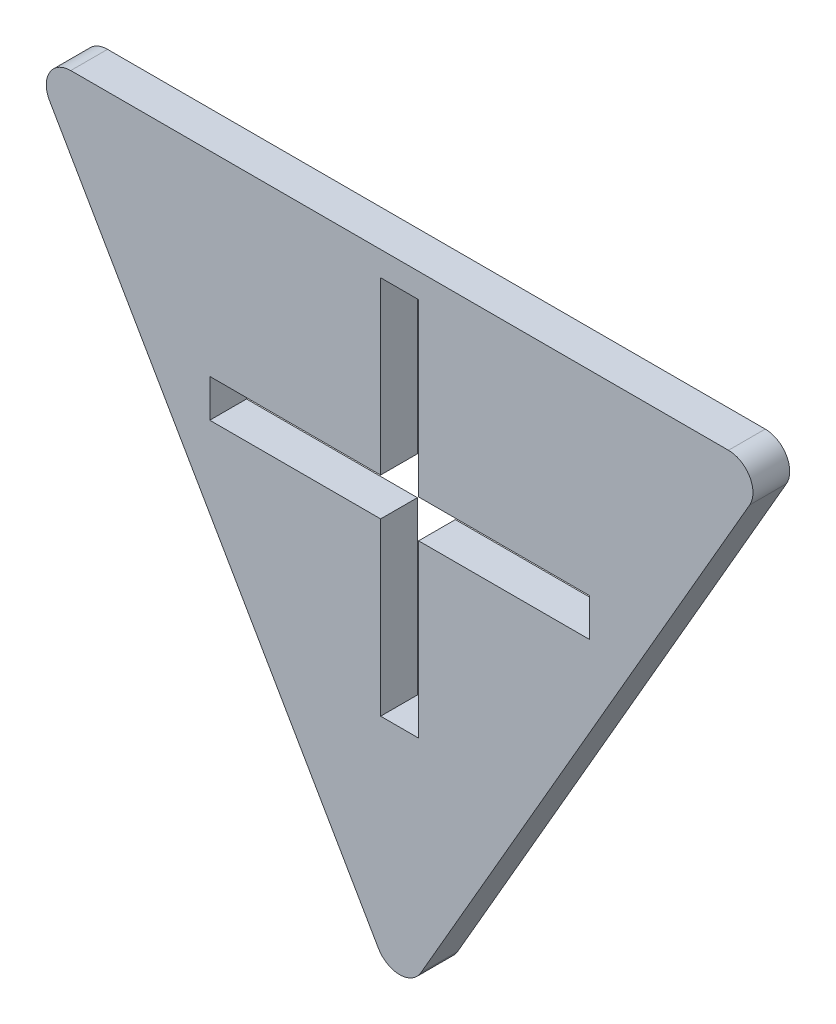
ISO-10303-21;
HEADER;
FILE_DESCRIPTION(('STEP AP214'),'2;1');
FILE_NAME('part.step','',(''),(''),'','','');
FILE_SCHEMA(('AUTOMOTIVE_DESIGN { 1 0 10303 214 1 1 1 1 }'));
ENDSEC;
DATA;
#1=APPLICATION_CONTEXT('core data for automotive mechanical design processes');
#2=APPLICATION_PROTOCOL_DEFINITION('international standard','automotive_design',2000,#1);
#3=PRODUCT_CONTEXT('',#1,'mechanical');
#4=PRODUCT('Part','Part','',(#3));
#5=PRODUCT_RELATED_PRODUCT_CATEGORY('part','',(#4));
#6=PRODUCT_DEFINITION_FORMATION('','',#4);
#7=PRODUCT_DEFINITION_CONTEXT('part definition',#1,'design');
#8=PRODUCT_DEFINITION('design','',#6,#7);
#9=PRODUCT_DEFINITION_SHAPE('','',#8);
#10=(LENGTH_UNIT() NAMED_UNIT(*) SI_UNIT(.MILLI.,.METRE.));
#11=(NAMED_UNIT(*) PLANE_ANGLE_UNIT() SI_UNIT($,.RADIAN.));
#12=(NAMED_UNIT(*) SI_UNIT($,.STERADIAN.) SOLID_ANGLE_UNIT());
#13=UNCERTAINTY_MEASURE_WITH_UNIT(LENGTH_MEASURE(1.E-05),#10,'distance_accuracy_value','');
#14=(GEOMETRIC_REPRESENTATION_CONTEXT(3) GLOBAL_UNCERTAINTY_ASSIGNED_CONTEXT((#13)) GLOBAL_UNIT_ASSIGNED_CONTEXT((#10,
#11,#12)) REPRESENTATION_CONTEXT('',''));
#15=CARTESIAN_POINT('',(0.,0.,0.));
#16=DIRECTION('',(0.,0.,1.));
#17=DIRECTION('',(1.,0.,0.));
#18=AXIS2_PLACEMENT_3D('',#15,#16,#17);
#19=CARTESIAN_POINT('',(0.,17.5,1.5));
#20=DIRECTION('',(0.,-1.,0.));
#21=DIRECTION('',(0.,0.,-1.));
#22=AXIS2_PLACEMENT_3D('',#19,#20,#21);
#23=PLANE('',#22);
#24=DIRECTION('',(-1.,0.,0.));
#25=VECTOR('',#24,1.);
#26=CARTESIAN_POINT('',(0.,17.5,-1.5));
#27=LINE('',#26,#25);
#28=CARTESIAN_POINT('',(26.8467875173176,17.5,-1.5));
#29=VERTEX_POINT('',#28);
#30=CARTESIAN_POINT('',(-26.8467875173176,17.5,-1.5));
#31=VERTEX_POINT('',#30);
#32=EDGE_CURVE('E224',#29,#31,#27,.T.);
#33=ORIENTED_EDGE('',*,*,#32,.T.);
#34=DIRECTION('',(0.,0.,-1.));
#35=VECTOR('',#34,1.);
#36=CARTESIAN_POINT('',(-26.8467875173176,17.5,1.5));
#37=LINE('',#36,#35);
#38=CARTESIAN_POINT('',(-26.8467875173176,17.5,1.5));
#39=VERTEX_POINT('',#38);
#40=EDGE_CURVE('E11',#39,#31,#37,.T.);
#41=ORIENTED_EDGE('',*,*,#40,.F.);
#42=DIRECTION('',(-1.,0.,0.));
#43=VECTOR('',#42,1.);
#44=CARTESIAN_POINT('',(0.,17.5,1.5));
#45=LINE('',#44,#43);
#46=CARTESIAN_POINT('',(26.8467875173176,17.5,1.5));
#47=VERTEX_POINT('',#46);
#48=EDGE_CURVE('E322',#47,#39,#45,.T.);
#49=ORIENTED_EDGE('',*,*,#48,.F.);
#50=DIRECTION('',(0.,0.,-1.));
#51=VECTOR('',#50,1.);
#52=CARTESIAN_POINT('',(26.8467875173176,17.5,1.5));
#53=LINE('',#52,#51);
#54=EDGE_CURVE('E236',#47,#29,#53,.T.);
#55=ORIENTED_EDGE('',*,*,#54,.T.);
#56=EDGE_LOOP('',(#33,#41,#49,#55));
#57=FACE_BOUND('',#56,.T.);
#58=ADVANCED_FACE('F35',(#57),#23,.F.);
#59=CARTESIAN_POINT('',(-26.8467875173176,15.5,1.5));
#60=DIRECTION('',(0.,0.,-1.));
#61=DIRECTION('',(-1.,0.,0.));
#62=AXIS2_PLACEMENT_3D('',#59,#60,#61);
#63=CYLINDRICAL_SURFACE('',#62,2.);
#64=CARTESIAN_POINT('',(-26.8467875173176,15.5,-1.5));
#65=DIRECTION('',(0.,0.,1.));
#66=DIRECTION('',(1.,0.,0.));
#67=AXIS2_PLACEMENT_3D('',#64,#65,#66);
#68=CIRCLE('',#67,2.);
#69=CARTESIAN_POINT('',(-28.5788383248865,14.5,-1.5));
#70=VERTEX_POINT('',#69);
#71=EDGE_CURVE('E227',#31,#70,#68,.T.);
#72=ORIENTED_EDGE('',*,*,#71,.T.);
#73=DIRECTION('',(0.,0.,-1.));
#74=VECTOR('',#73,1.);
#75=CARTESIAN_POINT('',(-28.5788383248865,14.5,1.5));
#76=LINE('',#75,#74);
#77=CARTESIAN_POINT('',(-28.5788383248865,14.5,1.5));
#78=VERTEX_POINT('',#77);
#79=EDGE_CURVE('E45',#78,#70,#76,.T.);
#80=ORIENTED_EDGE('',*,*,#79,.F.);
#81=CARTESIAN_POINT('',(-26.8467875173176,15.5,1.5));
#82=DIRECTION('',(0.,0.,1.));
#83=DIRECTION('',(1.,0.,0.));
#84=AXIS2_PLACEMENT_3D('',#81,#82,#83);
#85=CIRCLE('',#84,2.);
#86=EDGE_CURVE('E191',#39,#78,#85,.T.);
#87=ORIENTED_EDGE('',*,*,#86,.F.);
#88=ORIENTED_EDGE('',*,*,#40,.T.);
#89=EDGE_LOOP('',(#72,#80,#87,#88));
#90=FACE_BOUND('',#89,.T.);
#91=ADVANCED_FACE('F353',(#90),#63,.T.);
#92=CARTESIAN_POINT('',(-15.1554445662277,-8.74999999999999,1.5));
#93=DIRECTION('',(0.866025403784439,0.5,0.));
#94=DIRECTION('',(-0.5,0.866025403784439,0.));
#95=AXIS2_PLACEMENT_3D('',#92,#93,#94);
#96=PLANE('',#95);
#97=DIRECTION('',(0.5,-0.866025403784439,0.));
#98=VECTOR('',#97,1.);
#99=CARTESIAN_POINT('',(-15.1554445662277,-8.74999999999999,-1.5));
#100=LINE('',#99,#98);
#101=CARTESIAN_POINT('',(-1.73205080756888,-32.,-1.5));
#102=VERTEX_POINT('',#101);
#103=EDGE_CURVE('E229',#70,#102,#100,.T.);
#104=ORIENTED_EDGE('',*,*,#103,.T.);
#105=DIRECTION('',(0.,0.,-1.));
#106=VECTOR('',#105,1.);
#107=CARTESIAN_POINT('',(-1.73205080756888,-32.,1.5));
#108=LINE('',#107,#106);
#109=CARTESIAN_POINT('',(-1.73205080756888,-32.,1.5));
#110=VERTEX_POINT('',#109);
#111=EDGE_CURVE('E180',#110,#102,#108,.T.);
#112=ORIENTED_EDGE('',*,*,#111,.F.);
#113=DIRECTION('',(0.5,-0.866025403784439,0.));
#114=VECTOR('',#113,1.);
#115=CARTESIAN_POINT('',(-15.1554445662277,-8.74999999999999,1.5));
#116=LINE('',#115,#114);
#117=EDGE_CURVE('E188',#78,#110,#116,.T.);
#118=ORIENTED_EDGE('',*,*,#117,.F.);
#119=ORIENTED_EDGE('',*,*,#79,.T.);
#120=EDGE_LOOP('',(#104,#112,#118,#119));
#121=FACE_BOUND('',#120,.T.);
#122=ADVANCED_FACE('F359',(#121),#96,.F.);
#123=CARTESIAN_POINT('',(0.,-31.,1.5));
#124=DIRECTION('',(0.,0.,-1.));
#125=DIRECTION('',(-1.,0.,0.));
#126=AXIS2_PLACEMENT_3D('',#123,#124,#125);
#127=CYLINDRICAL_SURFACE('',#126,2.);
#128=CARTESIAN_POINT('',(0.,-31.,-1.5));
#129=DIRECTION('',(0.,0.,1.));
#130=DIRECTION('',(1.,0.,0.));
#131=AXIS2_PLACEMENT_3D('',#128,#129,#130);
#132=CIRCLE('',#131,2.);
#133=CARTESIAN_POINT('',(1.73205080756888,-32.,-1.5));
#134=VERTEX_POINT('',#133);
#135=EDGE_CURVE('E179',#134,#102,#132,.F.);
#136=ORIENTED_EDGE('',*,*,#135,.F.);
#137=DIRECTION('',(0.,0.,-1.));
#138=VECTOR('',#137,1.);
#139=CARTESIAN_POINT('',(1.73205080756888,-32.,1.5));
#140=LINE('',#139,#138);
#141=CARTESIAN_POINT('',(1.73205080756888,-32.,1.5));
#142=VERTEX_POINT('',#141);
#143=EDGE_CURVE('E173',#142,#134,#140,.T.);
#144=ORIENTED_EDGE('',*,*,#143,.F.);
#145=CARTESIAN_POINT('',(0.,-31.,1.5));
#146=DIRECTION('',(0.,0.,1.));
#147=DIRECTION('',(1.,0.,0.));
#148=AXIS2_PLACEMENT_3D('',#145,#146,#147);
#149=CIRCLE('',#148,2.);
#150=EDGE_CURVE('E177',#142,#110,#149,.F.);
#151=ORIENTED_EDGE('',*,*,#150,.T.);
#152=ORIENTED_EDGE('',*,*,#111,.T.);
#153=EDGE_LOOP('',(#136,#144,#151,#152));
#154=FACE_BOUND('',#153,.T.);
#155=ADVANCED_FACE('F175',(#154),#127,.T.);
#156=CARTESIAN_POINT('',(15.1554445662277,-8.75,1.5));
#157=DIRECTION('',(-0.866025403784439,0.5,0.));
#158=DIRECTION('',(-0.5,-0.866025403784439,0.));
#159=AXIS2_PLACEMENT_3D('',#156,#157,#158);
#160=PLANE('',#159);
#161=DIRECTION('',(0.5,0.866025403784439,0.));
#162=VECTOR('',#161,1.);
#163=CARTESIAN_POINT('',(15.1554445662277,-8.75,-1.5));
#164=LINE('',#163,#162);
#165=CARTESIAN_POINT('',(28.5788383248865,14.5,-1.5));
#166=VERTEX_POINT('',#165);
#167=EDGE_CURVE('E112',#134,#166,#164,.T.);
#168=ORIENTED_EDGE('',*,*,#167,.T.);
#169=DIRECTION('',(0.,0.,-1.));
#170=VECTOR('',#169,1.);
#171=CARTESIAN_POINT('',(28.5788383248865,14.5,1.5));
#172=LINE('',#171,#170);
#173=CARTESIAN_POINT('',(28.5788383248865,14.5,1.5));
#174=VERTEX_POINT('',#173);
#175=EDGE_CURVE('E181',#174,#166,#172,.T.);
#176=ORIENTED_EDGE('',*,*,#175,.F.);
#177=DIRECTION('',(0.5,0.866025403784439,0.));
#178=VECTOR('',#177,1.);
#179=CARTESIAN_POINT('',(15.1554445662277,-8.75,1.5));
#180=LINE('',#179,#178);
#181=EDGE_CURVE('E183',#142,#174,#180,.T.);
#182=ORIENTED_EDGE('',*,*,#181,.F.);
#183=ORIENTED_EDGE('',*,*,#143,.T.);
#184=EDGE_LOOP('',(#168,#176,#182,#183));
#185=FACE_BOUND('',#184,.T.);
#186=ADVANCED_FACE('F184',(#185),#160,.F.);
#187=CARTESIAN_POINT('',(0.,1.55000000000001,1.5));
#188=DIRECTION('',(0.,1.,0.));
#189=DIRECTION('',(0.,0.,1.));
#190=AXIS2_PLACEMENT_3D('',#187,#188,#189);
#191=PLANE('',#190);
#192=DIRECTION('',(1.,0.,0.));
#193=VECTOR('',#192,1.);
#194=CARTESIAN_POINT('',(0.,1.55000000000001,-1.5));
#195=LINE('',#194,#193);
#196=CARTESIAN_POINT('',(1.55,1.55000000000001,-1.5));
#197=VERTEX_POINT('',#196);
#198=CARTESIAN_POINT('',(15.5,1.55000000000001,-1.5));
#199=VERTEX_POINT('',#198);
#200=EDGE_CURVE('E197',#197,#199,#195,.T.);
#201=ORIENTED_EDGE('',*,*,#200,.T.);
#202=DIRECTION('',(0.,0.,-1.));
#203=VECTOR('',#202,1.);
#204=CARTESIAN_POINT('',(15.5,1.55000000000001,1.5));
#205=LINE('',#204,#203);
#206=CARTESIAN_POINT('',(15.5,1.55000000000001,1.5));
#207=VERTEX_POINT('',#206);
#208=EDGE_CURVE('E39',#207,#199,#205,.T.);
#209=ORIENTED_EDGE('',*,*,#208,.F.);
#210=DIRECTION('',(1.,0.,0.));
#211=VECTOR('',#210,1.);
#212=CARTESIAN_POINT('',(0.,1.55000000000001,1.5));
#213=LINE('',#212,#211);
#214=CARTESIAN_POINT('',(1.55,1.55000000000001,1.5));
#215=VERTEX_POINT('',#214);
#216=EDGE_CURVE('E235',#215,#207,#213,.T.);
#217=ORIENTED_EDGE('',*,*,#216,.F.);
#218=DIRECTION('',(0.,0.,-1.));
#219=VECTOR('',#218,1.);
#220=CARTESIAN_POINT('',(1.55,1.55000000000001,1.5));
#221=LINE('',#220,#219);
#222=EDGE_CURVE('E196',#215,#197,#221,.T.);
#223=ORIENTED_EDGE('',*,*,#222,.T.);
#224=EDGE_LOOP('',(#201,#209,#217,#223));
#225=FACE_BOUND('',#224,.T.);
#226=ADVANCED_FACE('F270',(#225),#191,.F.);
#227=CARTESIAN_POINT('',(15.5,0.,1.5));
#228=DIRECTION('',(1.,0.,0.));
#229=DIRECTION('',(0.,0.,-1.));
#230=AXIS2_PLACEMENT_3D('',#227,#228,#229);
#231=PLANE('',#230);
#232=DIRECTION('',(0.,-1.,0.));
#233=VECTOR('',#232,1.);
#234=CARTESIAN_POINT('',(15.5,0.,-1.5));
#235=LINE('',#234,#233);
#236=CARTESIAN_POINT('',(15.5,-1.54999999999999,-1.5));
#237=VERTEX_POINT('',#236);
#238=EDGE_CURVE('E200',#199,#237,#235,.T.);
#239=ORIENTED_EDGE('',*,*,#238,.T.);
#240=DIRECTION('',(0.,0.,-1.));
#241=VECTOR('',#240,1.);
#242=CARTESIAN_POINT('',(15.5,-1.54999999999999,1.5));
#243=LINE('',#242,#241);
#244=CARTESIAN_POINT('',(15.5,-1.54999999999999,1.5));
#245=VERTEX_POINT('',#244);
#246=EDGE_CURVE('E262',#245,#237,#243,.T.);
#247=ORIENTED_EDGE('',*,*,#246,.F.);
#248=DIRECTION('',(0.,-1.,0.));
#249=VECTOR('',#248,1.);
#250=CARTESIAN_POINT('',(15.5,0.,1.5));
#251=LINE('',#250,#249);
#252=EDGE_CURVE('E127',#207,#245,#251,.T.);
#253=ORIENTED_EDGE('',*,*,#252,.F.);
#254=ORIENTED_EDGE('',*,*,#208,.T.);
#255=EDGE_LOOP('',(#239,#247,#253,#254));
#256=FACE_BOUND('',#255,.T.);
#257=ADVANCED_FACE('F37',(#256),#231,.F.);
#258=CARTESIAN_POINT('',(0.,-1.54999999999999,1.5));
#259=DIRECTION('',(0.,1.,0.));
#260=DIRECTION('',(0.,0.,1.));
#261=AXIS2_PLACEMENT_3D('',#258,#259,#260);
#262=PLANE('',#261);
#263=DIRECTION('',(1.,0.,0.));
#264=VECTOR('',#263,1.);
#265=CARTESIAN_POINT('',(0.,-1.54999999999999,-1.5));
#266=LINE('',#265,#264);
#267=CARTESIAN_POINT('',(1.55,-1.54999999999999,-1.5));
#268=VERTEX_POINT('',#267);
#269=EDGE_CURVE('E204',#268,#237,#266,.T.);
#270=ORIENTED_EDGE('',*,*,#269,.F.);
#271=DIRECTION('',(0.,0.,-1.));
#272=VECTOR('',#271,1.);
#273=CARTESIAN_POINT('',(1.55,-1.54999999999999,1.5));
#274=LINE('',#273,#272);
#275=CARTESIAN_POINT('',(1.55,-1.54999999999999,1.5));
#276=VERTEX_POINT('',#275);
#277=EDGE_CURVE('E261',#276,#268,#274,.T.);
#278=ORIENTED_EDGE('',*,*,#277,.F.);
#279=DIRECTION('',(1.,0.,0.));
#280=VECTOR('',#279,1.);
#281=CARTESIAN_POINT('',(0.,-1.54999999999999,1.5));
#282=LINE('',#281,#280);
#283=EDGE_CURVE('E281',#276,#245,#282,.T.);
#284=ORIENTED_EDGE('',*,*,#283,.T.);
#285=ORIENTED_EDGE('',*,*,#246,.T.);
#286=EDGE_LOOP('',(#270,#278,#284,#285));
#287=FACE_BOUND('',#286,.T.);
#288=ADVANCED_FACE('F278',(#287),#262,.T.);
#289=CARTESIAN_POINT('',(1.55,0.,1.5));
#290=DIRECTION('',(1.,0.,0.));
#291=DIRECTION('',(0.,1.,0.));
#292=AXIS2_PLACEMENT_3D('',#289,#290,#291);
#293=PLANE('',#292);
#294=DIRECTION('',(0.,-1.,0.));
#295=VECTOR('',#294,1.);
#296=CARTESIAN_POINT('',(1.55,0.,-1.5));
#297=LINE('',#296,#295);
#298=CARTESIAN_POINT('',(1.55,-15.5,-1.5));
#299=VERTEX_POINT('',#298);
#300=EDGE_CURVE('E207',#268,#299,#297,.T.);
#301=ORIENTED_EDGE('',*,*,#300,.T.);
#302=DIRECTION('',(0.,0.,-1.));
#303=VECTOR('',#302,1.);
#304=CARTESIAN_POINT('',(1.55,-15.5,1.5));
#305=LINE('',#304,#303);
#306=CARTESIAN_POINT('',(1.55,-15.5,1.5));
#307=VERTEX_POINT('',#306);
#308=EDGE_CURVE('E259',#307,#299,#305,.T.);
#309=ORIENTED_EDGE('',*,*,#308,.F.);
#310=DIRECTION('',(0.,-1.,0.));
#311=VECTOR('',#310,1.);
#312=CARTESIAN_POINT('',(1.55,0.,1.5));
#313=LINE('',#312,#311);
#314=EDGE_CURVE('E284',#276,#307,#313,.T.);
#315=ORIENTED_EDGE('',*,*,#314,.F.);
#316=ORIENTED_EDGE('',*,*,#277,.T.);
#317=EDGE_LOOP('',(#301,#309,#315,#316));
#318=FACE_BOUND('',#317,.T.);
#319=ADVANCED_FACE('F285',(#318),#293,.F.);
#320=CARTESIAN_POINT('',(0.,-15.5,1.5));
#321=DIRECTION('',(0.,1.,0.));
#322=DIRECTION('',(0.,0.,1.));
#323=AXIS2_PLACEMENT_3D('',#320,#321,#322);
#324=PLANE('',#323);
#325=DIRECTION('',(1.,0.,0.));
#326=VECTOR('',#325,1.);
#327=CARTESIAN_POINT('',(0.,-15.5,-1.5));
#328=LINE('',#327,#326);
#329=CARTESIAN_POINT('',(-1.55,-15.5,-1.5));
#330=VERTEX_POINT('',#329);
#331=EDGE_CURVE('E211',#330,#299,#328,.T.);
#332=ORIENTED_EDGE('',*,*,#331,.F.);
#333=DIRECTION('',(0.,0.,-1.));
#334=VECTOR('',#333,1.);
#335=CARTESIAN_POINT('',(-1.55,-15.5,1.5));
#336=LINE('',#335,#334);
#337=CARTESIAN_POINT('',(-1.55,-15.5,1.5));
#338=VERTEX_POINT('',#337);
#339=EDGE_CURVE('E257',#338,#330,#336,.T.);
#340=ORIENTED_EDGE('',*,*,#339,.F.);
#341=DIRECTION('',(1.,0.,0.));
#342=VECTOR('',#341,1.);
#343=CARTESIAN_POINT('',(0.,-15.5,1.5));
#344=LINE('',#343,#342);
#345=EDGE_CURVE('E289',#338,#307,#344,.T.);
#346=ORIENTED_EDGE('',*,*,#345,.T.);
#347=ORIENTED_EDGE('',*,*,#308,.T.);
#348=EDGE_LOOP('',(#332,#340,#346,#347));
#349=FACE_BOUND('',#348,.T.);
#350=ADVANCED_FACE('F343',(#349),#324,.T.);
#351=CARTESIAN_POINT('',(-1.55,0.,1.5));
#352=DIRECTION('',(1.,0.,0.));
#353=DIRECTION('',(0.,1.,0.));
#354=AXIS2_PLACEMENT_3D('',#351,#352,#353);
#355=PLANE('',#354);
#356=DIRECTION('',(0.,-1.,0.));
#357=VECTOR('',#356,1.);
#358=CARTESIAN_POINT('',(-1.55,0.,-1.5));
#359=LINE('',#358,#357);
#360=CARTESIAN_POINT('',(-1.55,-1.54999999999999,-1.5));
#361=VERTEX_POINT('',#360);
#362=EDGE_CURVE('E215',#361,#330,#359,.T.);
#363=ORIENTED_EDGE('',*,*,#362,.F.);
#364=DIRECTION('',(0.,0.,-1.));
#365=VECTOR('',#364,1.);
#366=CARTESIAN_POINT('',(-1.55,-1.54999999999999,1.5));
#367=LINE('',#366,#365);
#368=CARTESIAN_POINT('',(-1.55,-1.54999999999999,1.5));
#369=VERTEX_POINT('',#368);
#370=EDGE_CURVE('E255',#369,#361,#367,.T.);
#371=ORIENTED_EDGE('',*,*,#370,.F.);
#372=DIRECTION('',(0.,-1.,0.));
#373=VECTOR('',#372,1.);
#374=CARTESIAN_POINT('',(-1.55,0.,1.5));
#375=LINE('',#374,#373);
#376=EDGE_CURVE('E297',#369,#338,#375,.T.);
#377=ORIENTED_EDGE('',*,*,#376,.T.);
#378=ORIENTED_EDGE('',*,*,#339,.T.);
#379=EDGE_LOOP('',(#363,#371,#377,#378));
#380=FACE_BOUND('',#379,.T.);
#381=ADVANCED_FACE('F341',(#380),#355,.T.);
#382=CARTESIAN_POINT('',(-15.5,-1.54999999999999,-1.5));
#383=VERTEX_POINT('',#382);
#384=EDGE_CURVE('E208',#383,#361,#266,.T.);
#385=ORIENTED_EDGE('',*,*,#384,.F.);
#386=DIRECTION('',(0.,0.,-1.));
#387=VECTOR('',#386,1.);
#388=CARTESIAN_POINT('',(-15.5,-1.54999999999999,1.5));
#389=LINE('',#388,#387);
#390=CARTESIAN_POINT('',(-15.5,-1.54999999999999,1.5));
#391=VERTEX_POINT('',#390);
#392=EDGE_CURVE('E253',#391,#383,#389,.T.);
#393=ORIENTED_EDGE('',*,*,#392,.F.);
#394=EDGE_CURVE('E293',#391,#369,#282,.T.);
#395=ORIENTED_EDGE('',*,*,#394,.T.);
#396=ORIENTED_EDGE('',*,*,#370,.T.);
#397=EDGE_LOOP('',(#385,#393,#395,#396));
#398=FACE_BOUND('',#397,.T.);
#399=ADVANCED_FACE('F338',(#398),#262,.T.);
#400=CARTESIAN_POINT('',(-15.5,0.,1.5));
#401=DIRECTION('',(1.,0.,0.));
#402=DIRECTION('',(0.,0.,-1.));
#403=AXIS2_PLACEMENT_3D('',#400,#401,#402);
#404=PLANE('',#403);
#405=DIRECTION('',(0.,-1.,0.));
#406=VECTOR('',#405,1.);
#407=CARTESIAN_POINT('',(-15.5,0.,-1.5));
#408=LINE('',#407,#406);
#409=CARTESIAN_POINT('',(-15.5,1.55000000000001,-1.5));
#410=VERTEX_POINT('',#409);
#411=EDGE_CURVE('E219',#410,#383,#408,.T.);
#412=ORIENTED_EDGE('',*,*,#411,.F.);
#413=DIRECTION('',(0.,0.,-1.));
#414=VECTOR('',#413,1.);
#415=CARTESIAN_POINT('',(-15.5,1.55000000000001,1.5));
#416=LINE('',#415,#414);
#417=CARTESIAN_POINT('',(-15.5,1.55000000000001,1.5));
#418=VERTEX_POINT('',#417);
#419=EDGE_CURVE('E251',#418,#410,#416,.T.);
#420=ORIENTED_EDGE('',*,*,#419,.F.);
#421=DIRECTION('',(0.,-1.,0.));
#422=VECTOR('',#421,1.);
#423=CARTESIAN_POINT('',(-15.5,0.,1.5));
#424=LINE('',#423,#422);
#425=EDGE_CURVE('E296',#418,#391,#424,.T.);
#426=ORIENTED_EDGE('',*,*,#425,.T.);
#427=ORIENTED_EDGE('',*,*,#392,.T.);
#428=EDGE_LOOP('',(#412,#420,#426,#427));
#429=FACE_BOUND('',#428,.T.);
#430=ADVANCED_FACE('F336',(#429),#404,.T.);
#431=CARTESIAN_POINT('',(-1.55,1.55000000000001,-1.5));
#432=VERTEX_POINT('',#431);
#433=EDGE_CURVE('E201',#410,#432,#195,.T.);
#434=ORIENTED_EDGE('',*,*,#433,.T.);
#435=DIRECTION('',(0.,0.,-1.));
#436=VECTOR('',#435,1.);
#437=CARTESIAN_POINT('',(-1.55,1.55000000000001,1.5));
#438=LINE('',#437,#436);
#439=CARTESIAN_POINT('',(-1.55,1.55000000000001,1.5));
#440=VERTEX_POINT('',#439);
#441=EDGE_CURVE('E249',#440,#432,#438,.T.);
#442=ORIENTED_EDGE('',*,*,#441,.F.);
#443=EDGE_CURVE('E301',#418,#440,#213,.T.);
#444=ORIENTED_EDGE('',*,*,#443,.F.);
#445=ORIENTED_EDGE('',*,*,#419,.T.);
#446=EDGE_LOOP('',(#434,#442,#444,#445));
#447=FACE_BOUND('',#446,.T.);
#448=ADVANCED_FACE('F332',(#447),#191,.F.);
#449=CARTESIAN_POINT('',(-1.55,15.5,-1.5));
#450=VERTEX_POINT('',#449);
#451=EDGE_CURVE('E218',#450,#432,#359,.T.);
#452=ORIENTED_EDGE('',*,*,#451,.F.);
#453=DIRECTION('',(0.,0.,-1.));
#454=VECTOR('',#453,1.);
#455=CARTESIAN_POINT('',(-1.55,15.5,1.5));
#456=LINE('',#455,#454);
#457=CARTESIAN_POINT('',(-1.55,15.5,1.5));
#458=VERTEX_POINT('',#457);
#459=EDGE_CURVE('E247',#458,#450,#456,.T.);
#460=ORIENTED_EDGE('',*,*,#459,.F.);
#461=EDGE_CURVE('E305',#458,#440,#375,.T.);
#462=ORIENTED_EDGE('',*,*,#461,.T.);
#463=ORIENTED_EDGE('',*,*,#441,.T.);
#464=EDGE_LOOP('',(#452,#460,#462,#463));
#465=FACE_BOUND('',#464,.T.);
#466=ADVANCED_FACE('F329',(#465),#355,.T.);
#467=CARTESIAN_POINT('',(0.,15.5,1.5));
#468=DIRECTION('',(0.,1.,0.));
#469=DIRECTION('',(0.,0.,1.));
#470=AXIS2_PLACEMENT_3D('',#467,#468,#469);
#471=PLANE('',#470);
#472=DIRECTION('',(1.,0.,0.));
#473=VECTOR('',#472,1.);
#474=CARTESIAN_POINT('',(0.,15.5,-1.5));
#475=LINE('',#474,#473);
#476=CARTESIAN_POINT('',(1.55,15.5,-1.5));
#477=VERTEX_POINT('',#476);
#478=EDGE_CURVE('E222',#450,#477,#475,.T.);
#479=ORIENTED_EDGE('',*,*,#478,.T.);
#480=DIRECTION('',(0.,0.,-1.));
#481=VECTOR('',#480,1.);
#482=CARTESIAN_POINT('',(1.55,15.5,1.5));
#483=LINE('',#482,#481);
#484=CARTESIAN_POINT('',(1.55,15.5,1.5));
#485=VERTEX_POINT('',#484);
#486=EDGE_CURVE('E244',#485,#477,#483,.T.);
#487=ORIENTED_EDGE('',*,*,#486,.F.);
#488=DIRECTION('',(1.,0.,0.));
#489=VECTOR('',#488,1.);
#490=CARTESIAN_POINT('',(0.,15.5,1.5));
#491=LINE('',#490,#489);
#492=EDGE_CURVE('E310',#458,#485,#491,.T.);
#493=ORIENTED_EDGE('',*,*,#492,.F.);
#494=ORIENTED_EDGE('',*,*,#459,.T.);
#495=EDGE_LOOP('',(#479,#487,#493,#494));
#496=FACE_BOUND('',#495,.T.);
#497=ADVANCED_FACE('F325',(#496),#471,.F.);
#498=EDGE_CURVE('E212',#477,#197,#297,.T.);
#499=ORIENTED_EDGE('',*,*,#498,.T.);
#500=ORIENTED_EDGE('',*,*,#222,.F.);
#501=EDGE_CURVE('E291',#485,#215,#313,.T.);
#502=ORIENTED_EDGE('',*,*,#501,.F.);
#503=ORIENTED_EDGE('',*,*,#486,.T.);
#504=EDGE_LOOP('',(#499,#500,#502,#503));
#505=FACE_BOUND('',#504,.T.);
#506=ADVANCED_FACE('F323',(#505),#293,.F.);
#507=CARTESIAN_POINT('',(26.8467875173176,15.5,1.5));
#508=DIRECTION('',(0.,0.,-1.));
#509=DIRECTION('',(-1.,0.,0.));
#510=AXIS2_PLACEMENT_3D('',#507,#508,#509);
#511=CYLINDRICAL_SURFACE('',#510,2.);
#512=CARTESIAN_POINT('',(26.8467875173176,15.5,-1.5));
#513=DIRECTION('',(0.,0.,1.));
#514=DIRECTION('',(1.,0.,0.));
#515=AXIS2_PLACEMENT_3D('',#512,#513,#514);
#516=CIRCLE('',#515,2.);
#517=EDGE_CURVE('E118',#166,#29,#516,.T.);
#518=ORIENTED_EDGE('',*,*,#517,.T.);
#519=ORIENTED_EDGE('',*,*,#54,.F.);
#520=CARTESIAN_POINT('',(26.8467875173176,15.5,1.5));
#521=DIRECTION('',(0.,0.,1.));
#522=DIRECTION('',(1.,0.,0.));
#523=AXIS2_PLACEMENT_3D('',#520,#521,#522);
#524=CIRCLE('',#523,2.);
#525=EDGE_CURVE('E54',#174,#47,#524,.T.);
#526=ORIENTED_EDGE('',*,*,#525,.F.);
#527=ORIENTED_EDGE('',*,*,#175,.T.);
#528=EDGE_LOOP('',(#518,#519,#526,#527));
#529=FACE_BOUND('',#528,.T.);
#530=ADVANCED_FACE('F365',(#529),#511,.T.);
#531=CARTESIAN_POINT('',(0.,0.,1.5));
#532=DIRECTION('',(0.,0.,1.));
#533=DIRECTION('',(1.,0.,0.));
#534=AXIS2_PLACEMENT_3D('',#531,#532,#533);
#535=PLANE('',#534);
#536=ORIENTED_EDGE('',*,*,#216,.T.);
#537=ORIENTED_EDGE('',*,*,#252,.T.);
#538=ORIENTED_EDGE('',*,*,#283,.F.);
#539=ORIENTED_EDGE('',*,*,#314,.T.);
#540=ORIENTED_EDGE('',*,*,#345,.F.);
#541=ORIENTED_EDGE('',*,*,#376,.F.);
#542=ORIENTED_EDGE('',*,*,#394,.F.);
#543=ORIENTED_EDGE('',*,*,#425,.F.);
#544=ORIENTED_EDGE('',*,*,#443,.T.);
#545=ORIENTED_EDGE('',*,*,#461,.F.);
#546=ORIENTED_EDGE('',*,*,#492,.T.);
#547=ORIENTED_EDGE('',*,*,#501,.T.);
#548=EDGE_LOOP('',(#536,#537,#538,#539,#540,#541,#542,#543,#544,#545,#546,#547));
#549=FACE_BOUND('',#548,.T.);
#550=ORIENTED_EDGE('',*,*,#48,.T.);
#551=ORIENTED_EDGE('',*,*,#86,.T.);
#552=ORIENTED_EDGE('',*,*,#117,.T.);
#553=ORIENTED_EDGE('',*,*,#150,.F.);
#554=ORIENTED_EDGE('',*,*,#181,.T.);
#555=ORIENTED_EDGE('',*,*,#525,.T.);
#556=EDGE_LOOP('',(#550,#551,#552,#553,#554,#555));
#557=FACE_BOUND('',#556,.T.);
#558=ADVANCED_FACE('F186',(#549,#557),#535,.T.);
#559=CARTESIAN_POINT('',(0.,0.,-1.5));
#560=DIRECTION('',(0.,0.,1.));
#561=DIRECTION('',(1.,0.,0.));
#562=AXIS2_PLACEMENT_3D('',#559,#560,#561);
#563=PLANE('',#562);
#564=ORIENTED_EDGE('',*,*,#200,.F.);
#565=ORIENTED_EDGE('',*,*,#498,.F.);
#566=ORIENTED_EDGE('',*,*,#478,.F.);
#567=ORIENTED_EDGE('',*,*,#451,.T.);
#568=ORIENTED_EDGE('',*,*,#433,.F.);
#569=ORIENTED_EDGE('',*,*,#411,.T.);
#570=ORIENTED_EDGE('',*,*,#384,.T.);
#571=ORIENTED_EDGE('',*,*,#362,.T.);
#572=ORIENTED_EDGE('',*,*,#331,.T.);
#573=ORIENTED_EDGE('',*,*,#300,.F.);
#574=ORIENTED_EDGE('',*,*,#269,.T.);
#575=ORIENTED_EDGE('',*,*,#238,.F.);
#576=EDGE_LOOP('',(#564,#565,#566,#567,#568,#569,#570,#571,#572,#573,#574,#575));
#577=FACE_BOUND('',#576,.T.);
#578=ORIENTED_EDGE('',*,*,#32,.F.);
#579=ORIENTED_EDGE('',*,*,#517,.F.);
#580=ORIENTED_EDGE('',*,*,#167,.F.);
#581=ORIENTED_EDGE('',*,*,#135,.T.);
#582=ORIENTED_EDGE('',*,*,#103,.F.);
#583=ORIENTED_EDGE('',*,*,#71,.F.);
#584=EDGE_LOOP('',(#578,#579,#580,#581,#582,#583));
#585=FACE_BOUND('',#584,.T.);
#586=ADVANCED_FACE('F274',(#577,#585),#563,.F.);
#587=CLOSED_SHELL('',(#58,#91,#122,#155,#186,#226,#257,#288,#319,#350,#381,#399,#430,#448,#466,
#497,#506,#530,#558,#586));
#588=MANIFOLD_SOLID_BREP('B2',#587);
#589=ADVANCED_BREP_SHAPE_REPRESENTATION('',(#18,#588),#14);
#590=SHAPE_DEFINITION_REPRESENTATION(#9,#589);
ENDSEC;
END-ISO-10303-21;
